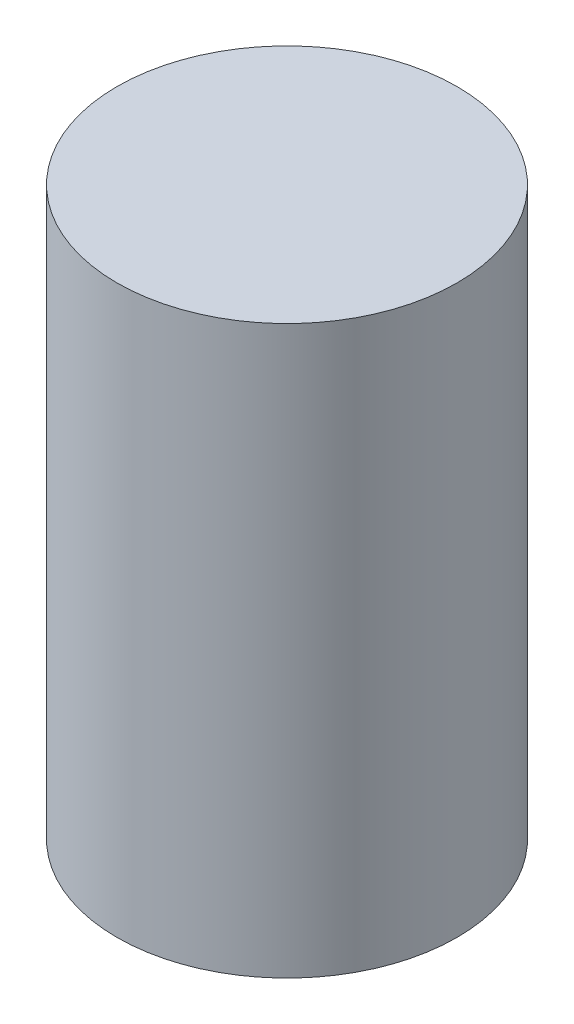
ISO-10303-21;
HEADER;
FILE_DESCRIPTION(('STEP AP214'),'2;1');
FILE_NAME('part.step','',(''),(''),'','','');
FILE_SCHEMA(('AUTOMOTIVE_DESIGN { 1 0 10303 214 1 1 1 1 }'));
ENDSEC;
DATA;
#1=APPLICATION_CONTEXT('core data for automotive mechanical design processes');
#2=APPLICATION_PROTOCOL_DEFINITION('international standard','automotive_design',2000,#1);
#3=PRODUCT_CONTEXT('',#1,'mechanical');
#4=PRODUCT('Part','Part','',(#3));
#5=PRODUCT_RELATED_PRODUCT_CATEGORY('part','',(#4));
#6=PRODUCT_DEFINITION_FORMATION('','',#4);
#7=PRODUCT_DEFINITION_CONTEXT('part definition',#1,'design');
#8=PRODUCT_DEFINITION('design','',#6,#7);
#9=PRODUCT_DEFINITION_SHAPE('','',#8);
#10=(LENGTH_UNIT() NAMED_UNIT(*) SI_UNIT(.MILLI.,.METRE.));
#11=(NAMED_UNIT(*) PLANE_ANGLE_UNIT() SI_UNIT($,.RADIAN.));
#12=(NAMED_UNIT(*) SI_UNIT($,.STERADIAN.) SOLID_ANGLE_UNIT());
#13=UNCERTAINTY_MEASURE_WITH_UNIT(LENGTH_MEASURE(1.E-05),#10,'distance_accuracy_value','');
#14=(GEOMETRIC_REPRESENTATION_CONTEXT(3) GLOBAL_UNCERTAINTY_ASSIGNED_CONTEXT((#13)) GLOBAL_UNIT_ASSIGNED_CONTEXT((#10,
#11,#12)) REPRESENTATION_CONTEXT('',''));
#15=CARTESIAN_POINT('',(0.,0.,0.));
#16=DIRECTION('',(0.,0.,1.));
#17=DIRECTION('',(1.,0.,0.));
#18=AXIS2_PLACEMENT_3D('',#15,#16,#17);
#19=CARTESIAN_POINT('',(0.,75.,0.));
#20=DIRECTION('',(0.,-1.,0.));
#21=DIRECTION('',(0.,0.,-1.));
#22=AXIS2_PLACEMENT_3D('',#19,#20,#21);
#23=CYLINDRICAL_SURFACE('',#22,22.5);
#24=CARTESIAN_POINT('',(0.,75.,0.));
#25=DIRECTION('',(0.,1.,0.));
#26=DIRECTION('',(0.,0.,1.));
#27=AXIS2_PLACEMENT_3D('',#24,#25,#26);
#28=CIRCLE('',#27,22.5);
#29=CARTESIAN_POINT('',(0.,75.,22.5));
#30=VERTEX_POINT('',#29);
#31=EDGE_CURVE('E12',#30,#30,#28,.T.);
#32=ORIENTED_EDGE('',*,*,#31,.F.);
#33=EDGE_LOOP('',(#32));
#34=FACE_BOUND('',#33,.T.);
#35=CARTESIAN_POINT('',(0.,0.,0.));
#36=DIRECTION('',(0.,1.,0.));
#37=DIRECTION('',(0.,0.,1.));
#38=AXIS2_PLACEMENT_3D('',#35,#36,#37);
#39=CIRCLE('',#38,22.5);
#40=CARTESIAN_POINT('',(0.,0.,22.5));
#41=VERTEX_POINT('',#40);
#42=EDGE_CURVE('E51',#41,#41,#39,.T.);
#43=ORIENTED_EDGE('',*,*,#42,.T.);
#44=EDGE_LOOP('',(#43));
#45=FACE_BOUND('',#44,.T.);
#46=ADVANCED_FACE('F48',(#34,#45),#23,.T.);
#47=CARTESIAN_POINT('',(0.,75.,0.));
#48=DIRECTION('',(0.,1.,0.));
#49=DIRECTION('',(0.,0.,1.));
#50=AXIS2_PLACEMENT_3D('',#47,#48,#49);
#51=PLANE('',#50);
#52=ORIENTED_EDGE('',*,*,#31,.T.);
#53=EDGE_LOOP('',(#52));
#54=FACE_BOUND('',#53,.T.);
#55=ADVANCED_FACE('F63',(#54),#51,.T.);
#56=CARTESIAN_POINT('',(0.,0.,0.));
#57=DIRECTION('',(0.,1.,0.));
#58=DIRECTION('',(0.,0.,1.));
#59=AXIS2_PLACEMENT_3D('',#56,#57,#58);
#60=PLANE('',#59);
#61=ORIENTED_EDGE('',*,*,#42,.F.);
#62=EDGE_LOOP('',(#61));
#63=FACE_BOUND('',#62,.T.);
#64=ADVANCED_FACE('F61',(#63),#60,.F.);
#65=CLOSED_SHELL('',(#46,#55,#64));
#66=MANIFOLD_SOLID_BREP('B2',#65);
#67=ADVANCED_BREP_SHAPE_REPRESENTATION('',(#18,#66),#14);
#68=SHAPE_DEFINITION_REPRESENTATION(#9,#67);
ENDSEC;
END-ISO-10303-21;
